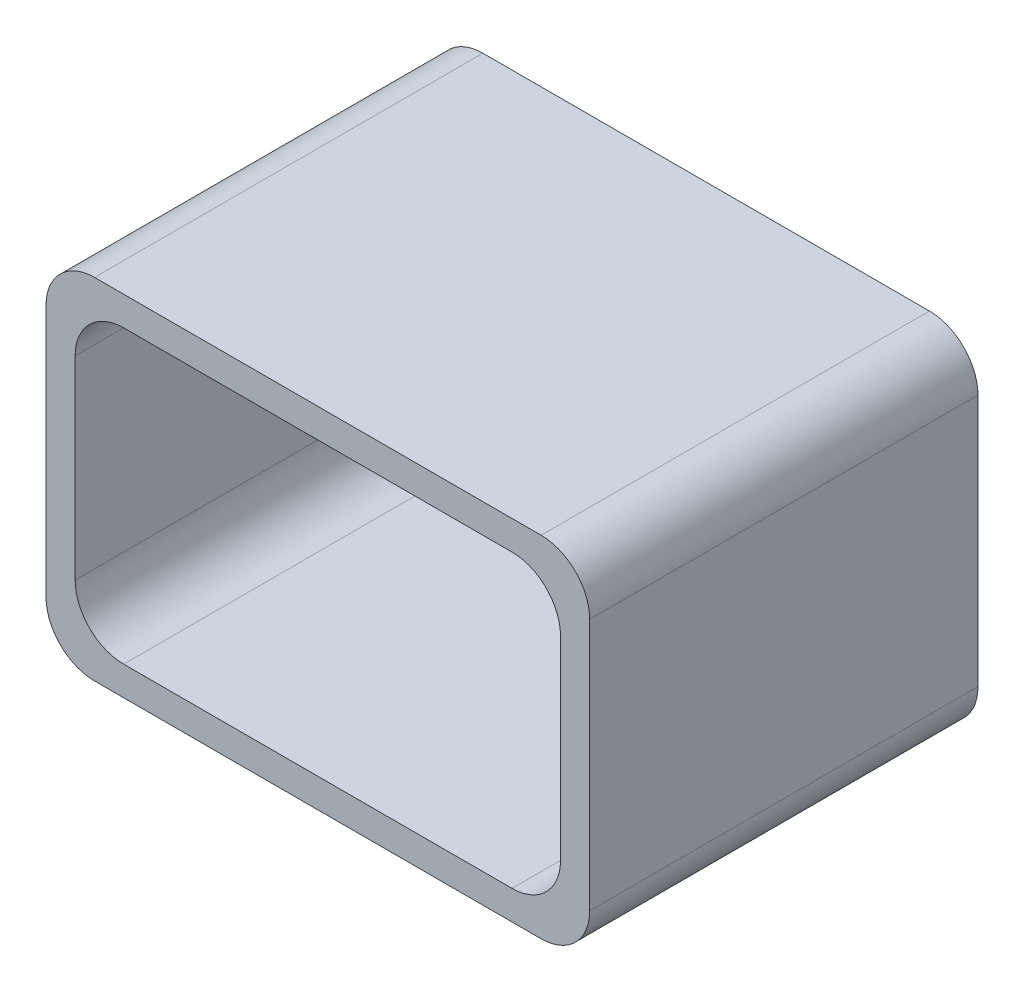
ISO-10303-21;
HEADER;
FILE_DESCRIPTION(('STEP AP214'),'2;1');
FILE_NAME('part.step','',(''),(''),'','','');
FILE_SCHEMA(('AUTOMOTIVE_DESIGN { 1 0 10303 214 1 1 1 1 }'));
ENDSEC;
DATA;
#1=APPLICATION_CONTEXT('core data for automotive mechanical design processes');
#2=APPLICATION_PROTOCOL_DEFINITION('international standard','automotive_design',2000,#1);
#3=PRODUCT_CONTEXT('',#1,'mechanical');
#4=PRODUCT('Part','Part','',(#3));
#5=PRODUCT_RELATED_PRODUCT_CATEGORY('part','',(#4));
#6=PRODUCT_DEFINITION_FORMATION('','',#4);
#7=PRODUCT_DEFINITION_CONTEXT('part definition',#1,'design');
#8=PRODUCT_DEFINITION('design','',#6,#7);
#9=PRODUCT_DEFINITION_SHAPE('','',#8);
#10=(LENGTH_UNIT() NAMED_UNIT(*) SI_UNIT(.MILLI.,.METRE.));
#11=(NAMED_UNIT(*) PLANE_ANGLE_UNIT() SI_UNIT($,.RADIAN.));
#12=(NAMED_UNIT(*) SI_UNIT($,.STERADIAN.) SOLID_ANGLE_UNIT());
#13=UNCERTAINTY_MEASURE_WITH_UNIT(LENGTH_MEASURE(1.E-05),#10,'distance_accuracy_value','');
#14=(GEOMETRIC_REPRESENTATION_CONTEXT(3) GLOBAL_UNCERTAINTY_ASSIGNED_CONTEXT((#13)) GLOBAL_UNIT_ASSIGNED_CONTEXT((#10,
#11,#12)) REPRESENTATION_CONTEXT('',''));
#15=CARTESIAN_POINT('',(0.,0.,0.));
#16=DIRECTION('',(0.,0.,1.));
#17=DIRECTION('',(1.,0.,0.));
#18=AXIS2_PLACEMENT_3D('',#15,#16,#17);
#19=CARTESIAN_POINT('',(0.,0.,0.4));
#20=DIRECTION('',(0.,0.,-1.));
#21=DIRECTION('',(-1.,0.,0.));
#22=AXIS2_PLACEMENT_3D('',#19,#20,#21);
#23=PLANE('',#22);
#24=DIRECTION('',(1.,0.,0.));
#25=VECTOR('',#24,1.);
#26=CARTESIAN_POINT('',(0.,0.,0.4));
#27=LINE('',#26,#25);
#28=CARTESIAN_POINT('',(0.05,0.,0.4));
#29=VERTEX_POINT('',#28);
#30=CARTESIAN_POINT('',(0.51,0.,0.4));
#31=VERTEX_POINT('',#30);
#32=EDGE_CURVE('E333',#29,#31,#27,.T.);
#33=ORIENTED_EDGE('',*,*,#32,.T.);
#34=CARTESIAN_POINT('',(0.51,0.05,0.4));
#35=DIRECTION('',(0.,0.,-1.));
#36=DIRECTION('',(-1.,0.,0.));
#37=AXIS2_PLACEMENT_3D('',#34,#35,#36);
#38=CIRCLE('',#37,0.05);
#39=CARTESIAN_POINT('',(0.56,0.05,0.4));
#40=VERTEX_POINT('',#39);
#41=EDGE_CURVE('E223',#31,#40,#38,.F.);
#42=ORIENTED_EDGE('',*,*,#41,.T.);
#43=DIRECTION('',(0.,1.,0.));
#44=VECTOR('',#43,1.);
#45=CARTESIAN_POINT('',(0.56,0.,0.4));
#46=LINE('',#45,#44);
#47=CARTESIAN_POINT('',(0.56,0.31,0.4));
#48=VERTEX_POINT('',#47);
#49=EDGE_CURVE('E178',#40,#48,#46,.T.);
#50=ORIENTED_EDGE('',*,*,#49,.T.);
#51=CARTESIAN_POINT('',(0.51,0.31,0.4));
#52=DIRECTION('',(0.,0.,-1.));
#53=DIRECTION('',(-1.,0.,0.));
#54=AXIS2_PLACEMENT_3D('',#51,#52,#53);
#55=CIRCLE('',#54,0.05);
#56=CARTESIAN_POINT('',(0.51,0.36,0.4));
#57=VERTEX_POINT('',#56);
#58=EDGE_CURVE('E217',#48,#57,#55,.F.);
#59=ORIENTED_EDGE('',*,*,#58,.T.);
#60=DIRECTION('',(-1.,0.,0.));
#61=VECTOR('',#60,1.);
#62=CARTESIAN_POINT('',(0.,0.36,0.4));
#63=LINE('',#62,#61);
#64=CARTESIAN_POINT('',(0.05,0.36,0.4));
#65=VERTEX_POINT('',#64);
#66=EDGE_CURVE('E201',#57,#65,#63,.T.);
#67=ORIENTED_EDGE('',*,*,#66,.T.);
#68=CARTESIAN_POINT('',(0.05,0.31,0.4));
#69=DIRECTION('',(0.,0.,-1.));
#70=DIRECTION('',(-1.,0.,0.));
#71=AXIS2_PLACEMENT_3D('',#68,#69,#70);
#72=CIRCLE('',#71,0.05);
#73=CARTESIAN_POINT('',(0.,0.31,0.4));
#74=VERTEX_POINT('',#73);
#75=EDGE_CURVE('E214',#65,#74,#72,.F.);
#76=ORIENTED_EDGE('',*,*,#75,.T.);
#77=DIRECTION('',(0.,-1.,0.));
#78=VECTOR('',#77,1.);
#79=CARTESIAN_POINT('',(0.,0.,0.4));
#80=LINE('',#79,#78);
#81=CARTESIAN_POINT('',(0.,0.05,0.4));
#82=VERTEX_POINT('',#81);
#83=EDGE_CURVE('E194',#74,#82,#80,.T.);
#84=ORIENTED_EDGE('',*,*,#83,.T.);
#85=CARTESIAN_POINT('',(0.05,0.05,0.4));
#86=DIRECTION('',(0.,0.,-1.));
#87=DIRECTION('',(-1.,0.,0.));
#88=AXIS2_PLACEMENT_3D('',#85,#86,#87);
#89=CIRCLE('',#88,0.05);
#90=EDGE_CURVE('E220',#82,#29,#89,.F.);
#91=ORIENTED_EDGE('',*,*,#90,.T.);
#92=EDGE_LOOP('',(#33,#42,#50,#59,#67,#76,#84,#91));
#93=FACE_BOUND('',#92,.T.);
#94=DIRECTION('',(0.,-1.,0.));
#95=VECTOR('',#94,1.);
#96=CARTESIAN_POINT('',(0.03,0.33,0.4));
#97=LINE('',#96,#95);
#98=CARTESIAN_POINT('',(0.03,0.28,0.4));
#99=VERTEX_POINT('',#98);
#100=CARTESIAN_POINT('',(0.03,0.08,0.4));
#101=VERTEX_POINT('',#100);
#102=EDGE_CURVE('E307',#99,#101,#97,.T.);
#103=ORIENTED_EDGE('',*,*,#102,.F.);
#104=CARTESIAN_POINT('',(0.08,0.28,0.4));
#105=DIRECTION('',(0.,0.,-1.));
#106=DIRECTION('',(-1.,0.,0.));
#107=AXIS2_PLACEMENT_3D('',#104,#105,#106);
#108=CIRCLE('',#107,0.05);
#109=CARTESIAN_POINT('',(0.08,0.33,0.4));
#110=VERTEX_POINT('',#109);
#111=EDGE_CURVE('E11',#99,#110,#108,.T.);
#112=ORIENTED_EDGE('',*,*,#111,.T.);
#113=DIRECTION('',(-1.,0.,0.));
#114=VECTOR('',#113,1.);
#115=CARTESIAN_POINT('',(0.03,0.33,0.4));
#116=LINE('',#115,#114);
#117=CARTESIAN_POINT('',(0.48,0.33,0.4));
#118=VERTEX_POINT('',#117);
#119=EDGE_CURVE('E305',#118,#110,#116,.T.);
#120=ORIENTED_EDGE('',*,*,#119,.F.);
#121=CARTESIAN_POINT('',(0.48,0.28,0.4));
#122=DIRECTION('',(0.,0.,-1.));
#123=DIRECTION('',(-1.,0.,0.));
#124=AXIS2_PLACEMENT_3D('',#121,#122,#123);
#125=CIRCLE('',#124,0.05);
#126=CARTESIAN_POINT('',(0.53,0.28,0.4));
#127=VERTEX_POINT('',#126);
#128=EDGE_CURVE('E275',#118,#127,#125,.T.);
#129=ORIENTED_EDGE('',*,*,#128,.T.);
#130=DIRECTION('',(0.,1.,0.));
#131=VECTOR('',#130,1.);
#132=CARTESIAN_POINT('',(0.53,0.33,0.4));
#133=LINE('',#132,#131);
#134=CARTESIAN_POINT('',(0.53,0.08,0.4));
#135=VERTEX_POINT('',#134);
#136=EDGE_CURVE('E312',#135,#127,#133,.T.);
#137=ORIENTED_EDGE('',*,*,#136,.F.);
#138=CARTESIAN_POINT('',(0.48,0.08,0.4));
#139=DIRECTION('',(0.,0.,-1.));
#140=DIRECTION('',(-1.,0.,0.));
#141=AXIS2_PLACEMENT_3D('',#138,#139,#140);
#142=CIRCLE('',#141,0.05);
#143=CARTESIAN_POINT('',(0.48,0.03,0.4));
#144=VERTEX_POINT('',#143);
#145=EDGE_CURVE('E58',#135,#144,#142,.T.);
#146=ORIENTED_EDGE('',*,*,#145,.T.);
#147=DIRECTION('',(1.,0.,0.));
#148=VECTOR('',#147,1.);
#149=CARTESIAN_POINT('',(0.03,0.03,0.4));
#150=LINE('',#149,#148);
#151=CARTESIAN_POINT('',(0.08,0.03,0.4));
#152=VERTEX_POINT('',#151);
#153=EDGE_CURVE('E318',#152,#144,#150,.T.);
#154=ORIENTED_EDGE('',*,*,#153,.F.);
#155=CARTESIAN_POINT('',(0.08,0.08,0.4));
#156=DIRECTION('',(0.,0.,-1.));
#157=DIRECTION('',(-1.,0.,0.));
#158=AXIS2_PLACEMENT_3D('',#155,#156,#157);
#159=CIRCLE('',#158,0.05);
#160=EDGE_CURVE('E281',#152,#101,#159,.T.);
#161=ORIENTED_EDGE('',*,*,#160,.T.);
#162=EDGE_LOOP('',(#103,#112,#120,#129,#137,#146,#154,#161));
#163=FACE_BOUND('',#162,.T.);
#164=ADVANCED_FACE('F42',(#93,#163),#23,.F.);
#165=CARTESIAN_POINT('',(0.,0.,0.));
#166=DIRECTION('',(0.,0.,-1.));
#167=DIRECTION('',(-1.,0.,0.));
#168=AXIS2_PLACEMENT_3D('',#165,#166,#167);
#169=PLANE('',#168);
#170=DIRECTION('',(0.,1.,0.));
#171=VECTOR('',#170,1.);
#172=CARTESIAN_POINT('',(0.56,0.,0.));
#173=LINE('',#172,#171);
#174=CARTESIAN_POINT('',(0.56,0.05,0.));
#175=VERTEX_POINT('',#174);
#176=CARTESIAN_POINT('',(0.56,0.31,0.));
#177=VERTEX_POINT('',#176);
#178=EDGE_CURVE('E175',#175,#177,#173,.T.);
#179=ORIENTED_EDGE('',*,*,#178,.F.);
#180=CARTESIAN_POINT('',(0.51,0.05,0.));
#181=DIRECTION('',(0.,0.,-1.));
#182=DIRECTION('',(-1.,0.,0.));
#183=AXIS2_PLACEMENT_3D('',#180,#181,#182);
#184=CIRCLE('',#183,0.05);
#185=CARTESIAN_POINT('',(0.51,0.,0.));
#186=VERTEX_POINT('',#185);
#187=EDGE_CURVE('E157',#175,#186,#184,.T.);
#188=ORIENTED_EDGE('',*,*,#187,.T.);
#189=DIRECTION('',(1.,0.,0.));
#190=VECTOR('',#189,1.);
#191=CARTESIAN_POINT('',(0.,0.,0.));
#192=LINE('',#191,#190);
#193=CARTESIAN_POINT('',(0.05,0.,0.));
#194=VERTEX_POINT('',#193);
#195=EDGE_CURVE('E189',#194,#186,#192,.T.);
#196=ORIENTED_EDGE('',*,*,#195,.F.);
#197=CARTESIAN_POINT('',(0.05,0.05,0.));
#198=DIRECTION('',(0.,0.,-1.));
#199=DIRECTION('',(-1.,0.,0.));
#200=AXIS2_PLACEMENT_3D('',#197,#198,#199);
#201=CIRCLE('',#200,0.05);
#202=CARTESIAN_POINT('',(0.,0.05,0.));
#203=VERTEX_POINT('',#202);
#204=EDGE_CURVE('E169',#194,#203,#201,.T.);
#205=ORIENTED_EDGE('',*,*,#204,.T.);
#206=DIRECTION('',(0.,-1.,0.));
#207=VECTOR('',#206,1.);
#208=CARTESIAN_POINT('',(0.,0.,0.));
#209=LINE('',#208,#207);
#210=CARTESIAN_POINT('',(0.,0.31,0.));
#211=VERTEX_POINT('',#210);
#212=EDGE_CURVE('E196',#211,#203,#209,.T.);
#213=ORIENTED_EDGE('',*,*,#212,.F.);
#214=CARTESIAN_POINT('',(0.05,0.31,0.));
#215=DIRECTION('',(0.,0.,-1.));
#216=DIRECTION('',(-1.,0.,0.));
#217=AXIS2_PLACEMENT_3D('',#214,#215,#216);
#218=CIRCLE('',#217,0.05);
#219=CARTESIAN_POINT('',(0.05,0.36,0.));
#220=VERTEX_POINT('',#219);
#221=EDGE_CURVE('E180',#211,#220,#218,.T.);
#222=ORIENTED_EDGE('',*,*,#221,.T.);
#223=DIRECTION('',(-1.,0.,0.));
#224=VECTOR('',#223,1.);
#225=CARTESIAN_POINT('',(0.,0.36,0.));
#226=LINE('',#225,#224);
#227=CARTESIAN_POINT('',(0.51,0.36,0.));
#228=VERTEX_POINT('',#227);
#229=EDGE_CURVE('E188',#228,#220,#226,.T.);
#230=ORIENTED_EDGE('',*,*,#229,.F.);
#231=CARTESIAN_POINT('',(0.51,0.31,0.));
#232=DIRECTION('',(0.,0.,-1.));
#233=DIRECTION('',(-1.,0.,0.));
#234=AXIS2_PLACEMENT_3D('',#231,#232,#233);
#235=CIRCLE('',#234,0.05);
#236=EDGE_CURVE('E186',#228,#177,#235,.T.);
#237=ORIENTED_EDGE('',*,*,#236,.T.);
#238=EDGE_LOOP('',(#179,#188,#196,#205,#213,#222,#230,#237));
#239=FACE_BOUND('',#238,.T.);
#240=DIRECTION('',(0.,1.,0.));
#241=VECTOR('',#240,1.);
#242=CARTESIAN_POINT('',(0.53,0.33,0.));
#243=LINE('',#242,#241);
#244=CARTESIAN_POINT('',(0.53,0.08,0.));
#245=VERTEX_POINT('',#244);
#246=CARTESIAN_POINT('',(0.53,0.28,0.));
#247=VERTEX_POINT('',#246);
#248=EDGE_CURVE('E325',#245,#247,#243,.T.);
#249=ORIENTED_EDGE('',*,*,#248,.T.);
#250=CARTESIAN_POINT('',(0.48,0.28,0.));
#251=DIRECTION('',(0.,0.,-1.));
#252=DIRECTION('',(-1.,0.,0.));
#253=AXIS2_PLACEMENT_3D('',#250,#251,#252);
#254=CIRCLE('',#253,0.05);
#255=CARTESIAN_POINT('',(0.48,0.33,0.));
#256=VERTEX_POINT('',#255);
#257=EDGE_CURVE('E272',#247,#256,#254,.F.);
#258=ORIENTED_EDGE('',*,*,#257,.T.);
#259=DIRECTION('',(-1.,0.,0.));
#260=VECTOR('',#259,1.);
#261=CARTESIAN_POINT('',(0.03,0.33,0.));
#262=LINE('',#261,#260);
#263=CARTESIAN_POINT('',(0.08,0.33,0.));
#264=VERTEX_POINT('',#263);
#265=EDGE_CURVE('E290',#256,#264,#262,.T.);
#266=ORIENTED_EDGE('',*,*,#265,.T.);
#267=CARTESIAN_POINT('',(0.08,0.28,0.));
#268=DIRECTION('',(0.,0.,-1.));
#269=DIRECTION('',(-1.,0.,0.));
#270=AXIS2_PLACEMENT_3D('',#267,#268,#269);
#271=CIRCLE('',#270,0.05);
#272=CARTESIAN_POINT('',(0.03,0.28,0.));
#273=VERTEX_POINT('',#272);
#274=EDGE_CURVE('E51',#264,#273,#271,.F.);
#275=ORIENTED_EDGE('',*,*,#274,.T.);
#276=DIRECTION('',(0.,-1.,0.));
#277=VECTOR('',#276,1.);
#278=CARTESIAN_POINT('',(0.03,0.33,0.));
#279=LINE('',#278,#277);
#280=CARTESIAN_POINT('',(0.03,0.08,0.));
#281=VERTEX_POINT('',#280);
#282=EDGE_CURVE('E288',#273,#281,#279,.T.);
#283=ORIENTED_EDGE('',*,*,#282,.T.);
#284=CARTESIAN_POINT('',(0.08,0.08,0.));
#285=DIRECTION('',(0.,0.,-1.));
#286=DIRECTION('',(-1.,0.,0.));
#287=AXIS2_PLACEMENT_3D('',#284,#285,#286);
#288=CIRCLE('',#287,0.05);
#289=CARTESIAN_POINT('',(0.08,0.03,0.));
#290=VERTEX_POINT('',#289);
#291=EDGE_CURVE('E278',#281,#290,#288,.F.);
#292=ORIENTED_EDGE('',*,*,#291,.T.);
#293=DIRECTION('',(1.,0.,0.));
#294=VECTOR('',#293,1.);
#295=CARTESIAN_POINT('',(0.03,0.03,0.));
#296=LINE('',#295,#294);
#297=CARTESIAN_POINT('',(0.48,0.03,0.));
#298=VERTEX_POINT('',#297);
#299=EDGE_CURVE('E300',#290,#298,#296,.T.);
#300=ORIENTED_EDGE('',*,*,#299,.T.);
#301=CARTESIAN_POINT('',(0.48,0.08,0.));
#302=DIRECTION('',(0.,0.,-1.));
#303=DIRECTION('',(-1.,0.,0.));
#304=AXIS2_PLACEMENT_3D('',#301,#302,#303);
#305=CIRCLE('',#304,0.05);
#306=EDGE_CURVE('E267',#298,#245,#305,.F.);
#307=ORIENTED_EDGE('',*,*,#306,.T.);
#308=EDGE_LOOP('',(#249,#258,#266,#275,#283,#292,#300,#307));
#309=FACE_BOUND('',#308,.T.);
#310=ADVANCED_FACE('F183',(#239,#309),#169,.T.);
#311=CARTESIAN_POINT('',(0.,0.,0.4));
#312=DIRECTION('',(1.,0.,0.));
#313=DIRECTION('',(0.,0.,-1.));
#314=AXIS2_PLACEMENT_3D('',#311,#312,#313);
#315=PLANE('',#314);
#316=ORIENTED_EDGE('',*,*,#212,.T.);
#317=DIRECTION('',(0.,0.,-1.));
#318=VECTOR('',#317,1.);
#319=CARTESIAN_POINT('',(0.,0.05,0.4));
#320=LINE('',#319,#318);
#321=EDGE_CURVE('E230',#203,#82,#320,.F.);
#322=ORIENTED_EDGE('',*,*,#321,.T.);
#323=ORIENTED_EDGE('',*,*,#83,.F.);
#324=DIRECTION('',(0.,0.,-1.));
#325=VECTOR('',#324,1.);
#326=CARTESIAN_POINT('',(0.,0.31,0.4));
#327=LINE('',#326,#325);
#328=EDGE_CURVE('E226',#74,#211,#327,.T.);
#329=ORIENTED_EDGE('',*,*,#328,.T.);
#330=EDGE_LOOP('',(#316,#322,#323,#329));
#331=FACE_BOUND('',#330,.T.);
#332=ADVANCED_FACE('F354',(#331),#315,.F.);
#333=CARTESIAN_POINT('',(0.,0.,0.4));
#334=DIRECTION('',(0.,1.,0.));
#335=DIRECTION('',(0.,0.,1.));
#336=AXIS2_PLACEMENT_3D('',#333,#334,#335);
#337=PLANE('',#336);
#338=ORIENTED_EDGE('',*,*,#195,.T.);
#339=DIRECTION('',(0.,0.,-1.));
#340=VECTOR('',#339,1.);
#341=CARTESIAN_POINT('',(0.51,0.,0.4));
#342=LINE('',#341,#340);
#343=EDGE_CURVE('E162',#186,#31,#342,.F.);
#344=ORIENTED_EDGE('',*,*,#343,.T.);
#345=ORIENTED_EDGE('',*,*,#32,.F.);
#346=DIRECTION('',(0.,0.,-1.));
#347=VECTOR('',#346,1.);
#348=CARTESIAN_POINT('',(0.05,0.,0.4));
#349=LINE('',#348,#347);
#350=EDGE_CURVE('E168',#29,#194,#349,.T.);
#351=ORIENTED_EDGE('',*,*,#350,.T.);
#352=EDGE_LOOP('',(#338,#344,#345,#351));
#353=FACE_BOUND('',#352,.T.);
#354=ADVANCED_FACE('F362',(#353),#337,.F.);
#355=CARTESIAN_POINT('',(0.56,0.,0.4));
#356=DIRECTION('',(-1.,0.,0.));
#357=DIRECTION('',(0.,0.,1.));
#358=AXIS2_PLACEMENT_3D('',#355,#356,#357);
#359=PLANE('',#358);
#360=ORIENTED_EDGE('',*,*,#49,.F.);
#361=DIRECTION('',(0.,0.,-1.));
#362=VECTOR('',#361,1.);
#363=CARTESIAN_POINT('',(0.56,0.05,0.4));
#364=LINE('',#363,#362);
#365=EDGE_CURVE('E161',#40,#175,#364,.T.);
#366=ORIENTED_EDGE('',*,*,#365,.T.);
#367=ORIENTED_EDGE('',*,*,#178,.T.);
#368=DIRECTION('',(0.,0.,-1.));
#369=VECTOR('',#368,1.);
#370=CARTESIAN_POINT('',(0.56,0.31,0.4));
#371=LINE('',#370,#369);
#372=EDGE_CURVE('E181',#177,#48,#371,.F.);
#373=ORIENTED_EDGE('',*,*,#372,.T.);
#374=EDGE_LOOP('',(#360,#366,#367,#373));
#375=FACE_BOUND('',#374,.T.);
#376=ADVANCED_FACE('F174',(#375),#359,.F.);
#377=CARTESIAN_POINT('',(0.,0.36,0.4));
#378=DIRECTION('',(0.,-1.,0.));
#379=DIRECTION('',(0.,0.,-1.));
#380=AXIS2_PLACEMENT_3D('',#377,#378,#379);
#381=PLANE('',#380);
#382=ORIENTED_EDGE('',*,*,#66,.F.);
#383=DIRECTION('',(0.,0.,-1.));
#384=VECTOR('',#383,1.);
#385=CARTESIAN_POINT('',(0.51,0.36,0.4));
#386=LINE('',#385,#384);
#387=EDGE_CURVE('E236',#57,#228,#386,.T.);
#388=ORIENTED_EDGE('',*,*,#387,.T.);
#389=ORIENTED_EDGE('',*,*,#229,.T.);
#390=DIRECTION('',(0.,0.,-1.));
#391=VECTOR('',#390,1.);
#392=CARTESIAN_POINT('',(0.05,0.36,0.4));
#393=LINE('',#392,#391);
#394=EDGE_CURVE('E233',#220,#65,#393,.F.);
#395=ORIENTED_EDGE('',*,*,#394,.T.);
#396=EDGE_LOOP('',(#382,#388,#389,#395));
#397=FACE_BOUND('',#396,.T.);
#398=ADVANCED_FACE('F365',(#397),#381,.F.);
#399=CARTESIAN_POINT('',(0.03,0.33,0.4));
#400=DIRECTION('',(1.,0.,0.));
#401=DIRECTION('',(0.,0.,-1.));
#402=AXIS2_PLACEMENT_3D('',#399,#400,#401);
#403=PLANE('',#402);
#404=ORIENTED_EDGE('',*,*,#102,.T.);
#405=DIRECTION('',(0.,0.,-1.));
#406=VECTOR('',#405,1.);
#407=CARTESIAN_POINT('',(0.03,0.08,0.));
#408=LINE('',#407,#406);
#409=EDGE_CURVE('E263',#101,#281,#408,.T.);
#410=ORIENTED_EDGE('',*,*,#409,.T.);
#411=ORIENTED_EDGE('',*,*,#282,.F.);
#412=DIRECTION('',(0.,0.,-1.));
#413=VECTOR('',#412,1.);
#414=CARTESIAN_POINT('',(0.03,0.28,0.4));
#415=LINE('',#414,#413);
#416=EDGE_CURVE('E260',#273,#99,#415,.F.);
#417=ORIENTED_EDGE('',*,*,#416,.T.);
#418=EDGE_LOOP('',(#404,#410,#411,#417));
#419=FACE_BOUND('',#418,.T.);
#420=ADVANCED_FACE('F296',(#419),#403,.T.);
#421=CARTESIAN_POINT('',(0.03,0.03,0.4));
#422=DIRECTION('',(0.,1.,0.));
#423=DIRECTION('',(0.,0.,1.));
#424=AXIS2_PLACEMENT_3D('',#421,#422,#423);
#425=PLANE('',#424);
#426=ORIENTED_EDGE('',*,*,#153,.T.);
#427=DIRECTION('',(0.,0.,-1.));
#428=VECTOR('',#427,1.);
#429=CARTESIAN_POINT('',(0.48,0.03,0.));
#430=LINE('',#429,#428);
#431=EDGE_CURVE('E242',#144,#298,#430,.T.);
#432=ORIENTED_EDGE('',*,*,#431,.T.);
#433=ORIENTED_EDGE('',*,*,#299,.F.);
#434=DIRECTION('',(0.,0.,-1.));
#435=VECTOR('',#434,1.);
#436=CARTESIAN_POINT('',(0.08,0.03,0.4));
#437=LINE('',#436,#435);
#438=EDGE_CURVE('E65',#290,#152,#437,.F.);
#439=ORIENTED_EDGE('',*,*,#438,.T.);
#440=EDGE_LOOP('',(#426,#432,#433,#439));
#441=FACE_BOUND('',#440,.T.);
#442=ADVANCED_FACE('F372',(#441),#425,.T.);
#443=CARTESIAN_POINT('',(0.53,0.33,0.4));
#444=DIRECTION('',(-1.,0.,0.));
#445=DIRECTION('',(0.,0.,1.));
#446=AXIS2_PLACEMENT_3D('',#443,#444,#445);
#447=PLANE('',#446);
#448=ORIENTED_EDGE('',*,*,#248,.F.);
#449=DIRECTION('',(0.,0.,-1.));
#450=VECTOR('',#449,1.);
#451=CARTESIAN_POINT('',(0.53,0.08,0.4));
#452=LINE('',#451,#450);
#453=EDGE_CURVE('E250',#245,#135,#452,.F.);
#454=ORIENTED_EDGE('',*,*,#453,.T.);
#455=ORIENTED_EDGE('',*,*,#136,.T.);
#456=DIRECTION('',(0.,0.,-1.));
#457=VECTOR('',#456,1.);
#458=CARTESIAN_POINT('',(0.53,0.28,0.));
#459=LINE('',#458,#457);
#460=EDGE_CURVE('E246',#127,#247,#459,.T.);
#461=ORIENTED_EDGE('',*,*,#460,.T.);
#462=EDGE_LOOP('',(#448,#454,#455,#461));
#463=FACE_BOUND('',#462,.T.);
#464=ADVANCED_FACE('F384',(#463),#447,.T.);
#465=CARTESIAN_POINT('',(0.03,0.33,0.4));
#466=DIRECTION('',(0.,-1.,0.));
#467=DIRECTION('',(0.,0.,-1.));
#468=AXIS2_PLACEMENT_3D('',#465,#466,#467);
#469=PLANE('',#468);
#470=ORIENTED_EDGE('',*,*,#265,.F.);
#471=DIRECTION('',(0.,0.,-1.));
#472=VECTOR('',#471,1.);
#473=CARTESIAN_POINT('',(0.48,0.33,0.4));
#474=LINE('',#473,#472);
#475=EDGE_CURVE('E257',#256,#118,#474,.F.);
#476=ORIENTED_EDGE('',*,*,#475,.T.);
#477=ORIENTED_EDGE('',*,*,#119,.T.);
#478=DIRECTION('',(0.,0.,-1.));
#479=VECTOR('',#478,1.);
#480=CARTESIAN_POINT('',(0.08,0.33,0.));
#481=LINE('',#480,#479);
#482=EDGE_CURVE('E253',#110,#264,#481,.T.);
#483=ORIENTED_EDGE('',*,*,#482,.T.);
#484=EDGE_LOOP('',(#470,#476,#477,#483));
#485=FACE_BOUND('',#484,.T.);
#486=ADVANCED_FACE('F309',(#485),#469,.T.);
#487=CARTESIAN_POINT('',(0.51,0.05,0.4));
#488=DIRECTION('',(0.,0.,-1.));
#489=DIRECTION('',(-1.,0.,0.));
#490=AXIS2_PLACEMENT_3D('',#487,#488,#489);
#491=CYLINDRICAL_SURFACE('',#490,0.05);
#492=ORIENTED_EDGE('',*,*,#41,.F.);
#493=ORIENTED_EDGE('',*,*,#343,.F.);
#494=ORIENTED_EDGE('',*,*,#187,.F.);
#495=ORIENTED_EDGE('',*,*,#365,.F.);
#496=EDGE_LOOP('',(#492,#493,#494,#495));
#497=FACE_BOUND('',#496,.T.);
#498=ADVANCED_FACE('F160',(#497),#491,.T.);
#499=CARTESIAN_POINT('',(0.05,0.05,0.4));
#500=DIRECTION('',(0.,0.,-1.));
#501=DIRECTION('',(-1.,0.,0.));
#502=AXIS2_PLACEMENT_3D('',#499,#500,#501);
#503=CYLINDRICAL_SURFACE('',#502,0.05);
#504=ORIENTED_EDGE('',*,*,#90,.F.);
#505=ORIENTED_EDGE('',*,*,#321,.F.);
#506=ORIENTED_EDGE('',*,*,#204,.F.);
#507=ORIENTED_EDGE('',*,*,#350,.F.);
#508=EDGE_LOOP('',(#504,#505,#506,#507));
#509=FACE_BOUND('',#508,.T.);
#510=ADVANCED_FACE('F359',(#509),#503,.T.);
#511=CARTESIAN_POINT('',(0.51,0.31,0.4));
#512=DIRECTION('',(0.,0.,-1.));
#513=DIRECTION('',(-1.,0.,0.));
#514=AXIS2_PLACEMENT_3D('',#511,#512,#513);
#515=CYLINDRICAL_SURFACE('',#514,0.05);
#516=ORIENTED_EDGE('',*,*,#58,.F.);
#517=ORIENTED_EDGE('',*,*,#372,.F.);
#518=ORIENTED_EDGE('',*,*,#236,.F.);
#519=ORIENTED_EDGE('',*,*,#387,.F.);
#520=EDGE_LOOP('',(#516,#517,#518,#519));
#521=FACE_BOUND('',#520,.T.);
#522=ADVANCED_FACE('F364',(#521),#515,.T.);
#523=CARTESIAN_POINT('',(0.05,0.31,0.4));
#524=DIRECTION('',(0.,0.,-1.));
#525=DIRECTION('',(-1.,0.,0.));
#526=AXIS2_PLACEMENT_3D('',#523,#524,#525);
#527=CYLINDRICAL_SURFACE('',#526,0.05);
#528=ORIENTED_EDGE('',*,*,#75,.F.);
#529=ORIENTED_EDGE('',*,*,#394,.F.);
#530=ORIENTED_EDGE('',*,*,#221,.F.);
#531=ORIENTED_EDGE('',*,*,#328,.F.);
#532=EDGE_LOOP('',(#528,#529,#530,#531));
#533=FACE_BOUND('',#532,.T.);
#534=ADVANCED_FACE('F351',(#533),#527,.T.);
#535=CARTESIAN_POINT('',(0.48,0.08,0.4));
#536=DIRECTION('',(0.,0.,1.));
#537=DIRECTION('',(1.,0.,0.));
#538=AXIS2_PLACEMENT_3D('',#535,#536,#537);
#539=CYLINDRICAL_SURFACE('',#538,0.05);
#540=ORIENTED_EDGE('',*,*,#145,.F.);
#541=ORIENTED_EDGE('',*,*,#453,.F.);
#542=ORIENTED_EDGE('',*,*,#306,.F.);
#543=ORIENTED_EDGE('',*,*,#431,.F.);
#544=EDGE_LOOP('',(#540,#541,#542,#543));
#545=FACE_BOUND('',#544,.T.);
#546=ADVANCED_FACE('F404',(#545),#539,.F.);
#547=CARTESIAN_POINT('',(0.48,0.28,0.4));
#548=DIRECTION('',(0.,0.,1.));
#549=DIRECTION('',(1.,0.,0.));
#550=AXIS2_PLACEMENT_3D('',#547,#548,#549);
#551=CYLINDRICAL_SURFACE('',#550,0.05);
#552=ORIENTED_EDGE('',*,*,#128,.F.);
#553=ORIENTED_EDGE('',*,*,#475,.F.);
#554=ORIENTED_EDGE('',*,*,#257,.F.);
#555=ORIENTED_EDGE('',*,*,#460,.F.);
#556=EDGE_LOOP('',(#552,#553,#554,#555));
#557=FACE_BOUND('',#556,.T.);
#558=ADVANCED_FACE('F407',(#557),#551,.F.);
#559=CARTESIAN_POINT('',(0.08,0.08,0.4));
#560=DIRECTION('',(0.,0.,1.));
#561=DIRECTION('',(1.,0.,0.));
#562=AXIS2_PLACEMENT_3D('',#559,#560,#561);
#563=CYLINDRICAL_SURFACE('',#562,0.05);
#564=ORIENTED_EDGE('',*,*,#160,.F.);
#565=ORIENTED_EDGE('',*,*,#438,.F.);
#566=ORIENTED_EDGE('',*,*,#291,.F.);
#567=ORIENTED_EDGE('',*,*,#409,.F.);
#568=EDGE_LOOP('',(#564,#565,#566,#567));
#569=FACE_BOUND('',#568,.T.);
#570=ADVANCED_FACE('F410',(#569),#563,.F.);
#571=CARTESIAN_POINT('',(0.08,0.28,0.4));
#572=DIRECTION('',(0.,0.,1.));
#573=DIRECTION('',(1.,0.,0.));
#574=AXIS2_PLACEMENT_3D('',#571,#572,#573);
#575=CYLINDRICAL_SURFACE('',#574,0.05);
#576=ORIENTED_EDGE('',*,*,#111,.F.);
#577=ORIENTED_EDGE('',*,*,#416,.F.);
#578=ORIENTED_EDGE('',*,*,#274,.F.);
#579=ORIENTED_EDGE('',*,*,#482,.F.);
#580=EDGE_LOOP('',(#576,#577,#578,#579));
#581=FACE_BOUND('',#580,.T.);
#582=ADVANCED_FACE('F44',(#581),#575,.F.);
#583=CLOSED_SHELL('',(#164,#310,#332,#354,#376,#398,#420,#442,#464,#486,#498,#510,#522,#534,
#546,#558,#570,#582));
#584=MANIFOLD_SOLID_BREP('B2',#583);
#585=ADVANCED_BREP_SHAPE_REPRESENTATION('',(#18,#584),#14);
#586=SHAPE_DEFINITION_REPRESENTATION(#9,#585);
ENDSEC;
END-ISO-10303-21;
